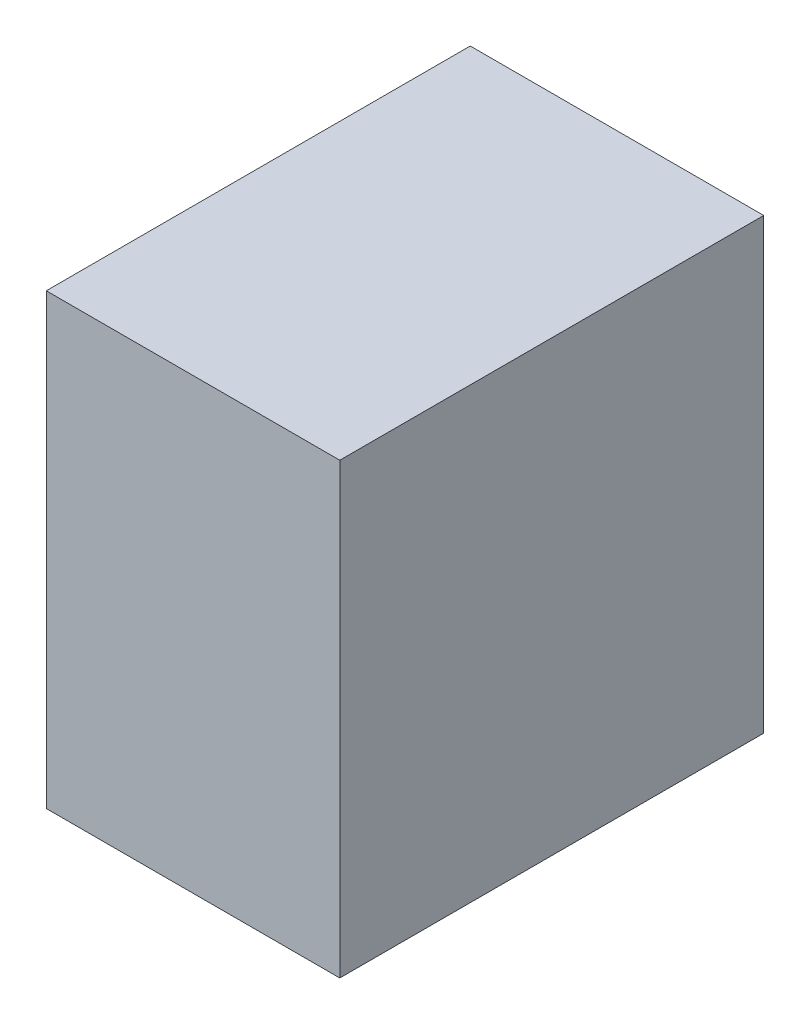
ISO-10303-21;
HEADER;
FILE_DESCRIPTION(('STEP AP214'),'2;1');
FILE_NAME('part.step','',(''),(''),'','','');
FILE_SCHEMA(('AUTOMOTIVE_DESIGN { 1 0 10303 214 1 1 1 1 }'));
ENDSEC;
DATA;
#1=APPLICATION_CONTEXT('core data for automotive mechanical design processes');
#2=APPLICATION_PROTOCOL_DEFINITION('international standard','automotive_design',2000,#1);
#3=PRODUCT_CONTEXT('',#1,'mechanical');
#4=PRODUCT('Part','Part','',(#3));
#5=PRODUCT_RELATED_PRODUCT_CATEGORY('part','',(#4));
#6=PRODUCT_DEFINITION_FORMATION('','',#4);
#7=PRODUCT_DEFINITION_CONTEXT('part definition',#1,'design');
#8=PRODUCT_DEFINITION('design','',#6,#7);
#9=PRODUCT_DEFINITION_SHAPE('','',#8);
#10=(LENGTH_UNIT() NAMED_UNIT(*) SI_UNIT(.MILLI.,.METRE.));
#11=(NAMED_UNIT(*) PLANE_ANGLE_UNIT() SI_UNIT($,.RADIAN.));
#12=(NAMED_UNIT(*) SI_UNIT($,.STERADIAN.) SOLID_ANGLE_UNIT());
#13=UNCERTAINTY_MEASURE_WITH_UNIT(LENGTH_MEASURE(1.E-05),#10,'distance_accuracy_value','');
#14=(GEOMETRIC_REPRESENTATION_CONTEXT(3) GLOBAL_UNCERTAINTY_ASSIGNED_CONTEXT((#13)) GLOBAL_UNIT_ASSIGNED_CONTEXT((#10,
#11,#12)) REPRESENTATION_CONTEXT('',''));
#15=CARTESIAN_POINT('',(0.,0.,0.));
#16=DIRECTION('',(0.,0.,1.));
#17=DIRECTION('',(1.,0.,0.));
#18=AXIS2_PLACEMENT_3D('',#15,#16,#17);
#19=CARTESIAN_POINT('',(-85.484794442748,55.,-24.1006217493925));
#20=DIRECTION('',(1.,0.,0.));
#21=DIRECTION('',(0.,0.,-1.));
#22=AXIS2_PLACEMENT_3D('',#19,#20,#21);
#23=PLANE('',#22);
#24=DIRECTION('',(0.,0.,1.));
#25=VECTOR('',#24,1.);
#26=CARTESIAN_POINT('',(-85.484794442748,0.,-24.1006217493925));
#27=LINE('',#26,#25);
#28=CARTESIAN_POINT('',(-85.484794442748,0.,-24.1006217493925));
#29=VERTEX_POINT('',#28);
#30=CARTESIAN_POINT('',(-85.484794442748,0.,27.8993782506075));
#31=VERTEX_POINT('',#30);
#32=EDGE_CURVE('E96',#29,#31,#27,.T.);
#33=ORIENTED_EDGE('',*,*,#32,.T.);
#34=DIRECTION('',(0.,-1.,0.));
#35=VECTOR('',#34,1.);
#36=CARTESIAN_POINT('',(-85.484794442748,55.,27.8993782506075));
#37=LINE('',#36,#35);
#38=CARTESIAN_POINT('',(-85.484794442748,55.,27.8993782506075));
#39=VERTEX_POINT('',#38);
#40=EDGE_CURVE('E11',#39,#31,#37,.T.);
#41=ORIENTED_EDGE('',*,*,#40,.F.);
#42=DIRECTION('',(0.,0.,1.));
#43=VECTOR('',#42,1.);
#44=CARTESIAN_POINT('',(-85.484794442748,55.,-24.1006217493925));
#45=LINE('',#44,#43);
#46=CARTESIAN_POINT('',(-85.484794442748,55.,-24.1006217493925));
#47=VERTEX_POINT('',#46);
#48=EDGE_CURVE('E84',#47,#39,#45,.T.);
#49=ORIENTED_EDGE('',*,*,#48,.F.);
#50=DIRECTION('',(0.,-1.,0.));
#51=VECTOR('',#50,1.);
#52=CARTESIAN_POINT('',(-85.484794442748,55.,-24.1006217493925));
#53=LINE('',#52,#51);
#54=EDGE_CURVE('E92',#47,#29,#53,.T.);
#55=ORIENTED_EDGE('',*,*,#54,.T.);
#56=EDGE_LOOP('',(#33,#41,#49,#55));
#57=FACE_BOUND('',#56,.T.);
#58=ADVANCED_FACE('F33',(#57),#23,.F.);
#59=CARTESIAN_POINT('',(-85.484794442748,55.,27.8993782506075));
#60=DIRECTION('',(0.,0.,-1.));
#61=DIRECTION('',(-1.,0.,0.));
#62=AXIS2_PLACEMENT_3D('',#59,#60,#61);
#63=PLANE('',#62);
#64=DIRECTION('',(1.,0.,0.));
#65=VECTOR('',#64,1.);
#66=CARTESIAN_POINT('',(-85.484794442748,0.,27.8993782506075));
#67=LINE('',#66,#65);
#68=CARTESIAN_POINT('',(-49.484794442748,0.,27.8993782506075));
#69=VERTEX_POINT('',#68);
#70=EDGE_CURVE('E88',#31,#69,#67,.T.);
#71=ORIENTED_EDGE('',*,*,#70,.T.);
#72=DIRECTION('',(0.,-1.,0.));
#73=VECTOR('',#72,1.);
#74=CARTESIAN_POINT('',(-49.484794442748,55.,27.8993782506075));
#75=LINE('',#74,#73);
#76=CARTESIAN_POINT('',(-49.484794442748,55.,27.8993782506075));
#77=VERTEX_POINT('',#76);
#78=EDGE_CURVE('E41',#77,#69,#75,.T.);
#79=ORIENTED_EDGE('',*,*,#78,.F.);
#80=DIRECTION('',(1.,0.,0.));
#81=VECTOR('',#80,1.);
#82=CARTESIAN_POINT('',(-85.484794442748,55.,27.8993782506075));
#83=LINE('',#82,#81);
#84=EDGE_CURVE('E79',#39,#77,#83,.T.);
#85=ORIENTED_EDGE('',*,*,#84,.F.);
#86=ORIENTED_EDGE('',*,*,#40,.T.);
#87=EDGE_LOOP('',(#71,#79,#85,#86));
#88=FACE_BOUND('',#87,.T.);
#89=ADVANCED_FACE('F87',(#88),#63,.F.);
#90=CARTESIAN_POINT('',(-49.484794442748,55.,-24.1006217493925));
#91=DIRECTION('',(-1.,0.,0.));
#92=DIRECTION('',(0.,0.,1.));
#93=AXIS2_PLACEMENT_3D('',#90,#91,#92);
#94=PLANE('',#93);
#95=DIRECTION('',(0.,0.,-1.));
#96=VECTOR('',#95,1.);
#97=CARTESIAN_POINT('',(-49.484794442748,0.,-24.1006217493925));
#98=LINE('',#97,#96);
#99=CARTESIAN_POINT('',(-49.484794442748,0.,-24.1006217493925));
#100=VERTEX_POINT('',#99);
#101=EDGE_CURVE('E66',#69,#100,#98,.T.);
#102=ORIENTED_EDGE('',*,*,#101,.T.);
#103=DIRECTION('',(0.,-1.,0.));
#104=VECTOR('',#103,1.);
#105=CARTESIAN_POINT('',(-49.484794442748,55.,-24.1006217493925));
#106=LINE('',#105,#104);
#107=CARTESIAN_POINT('',(-49.484794442748,55.,-24.1006217493925));
#108=VERTEX_POINT('',#107);
#109=EDGE_CURVE('E89',#108,#100,#106,.T.);
#110=ORIENTED_EDGE('',*,*,#109,.F.);
#111=DIRECTION('',(0.,0.,-1.));
#112=VECTOR('',#111,1.);
#113=CARTESIAN_POINT('',(-49.484794442748,55.,-24.1006217493925));
#114=LINE('',#113,#112);
#115=EDGE_CURVE('E82',#77,#108,#114,.T.);
#116=ORIENTED_EDGE('',*,*,#115,.F.);
#117=ORIENTED_EDGE('',*,*,#78,.T.);
#118=EDGE_LOOP('',(#102,#110,#116,#117));
#119=FACE_BOUND('',#118,.T.);
#120=ADVANCED_FACE('F90',(#119),#94,.F.);
#121=CARTESIAN_POINT('',(-85.484794442748,55.,-24.1006217493925));
#122=DIRECTION('',(0.,0.,1.));
#123=DIRECTION('',(1.,0.,0.));
#124=AXIS2_PLACEMENT_3D('',#121,#122,#123);
#125=PLANE('',#124);
#126=DIRECTION('',(-1.,0.,0.));
#127=VECTOR('',#126,1.);
#128=CARTESIAN_POINT('',(-85.484794442748,0.,-24.1006217493925));
#129=LINE('',#128,#127);
#130=EDGE_CURVE('E72',#100,#29,#129,.T.);
#131=ORIENTED_EDGE('',*,*,#130,.T.);
#132=ORIENTED_EDGE('',*,*,#54,.F.);
#133=DIRECTION('',(-1.,0.,0.));
#134=VECTOR('',#133,1.);
#135=CARTESIAN_POINT('',(-85.484794442748,55.,-24.1006217493925));
#136=LINE('',#135,#134);
#137=EDGE_CURVE('E49',#108,#47,#136,.T.);
#138=ORIENTED_EDGE('',*,*,#137,.F.);
#139=ORIENTED_EDGE('',*,*,#109,.T.);
#140=EDGE_LOOP('',(#131,#132,#138,#139));
#141=FACE_BOUND('',#140,.T.);
#142=ADVANCED_FACE('F103',(#141),#125,.F.);
#143=CARTESIAN_POINT('',(0.,55.,0.));
#144=DIRECTION('',(0.,1.,0.));
#145=DIRECTION('',(0.,0.,1.));
#146=AXIS2_PLACEMENT_3D('',#143,#144,#145);
#147=PLANE('',#146);
#148=ORIENTED_EDGE('',*,*,#48,.T.);
#149=ORIENTED_EDGE('',*,*,#84,.T.);
#150=ORIENTED_EDGE('',*,*,#115,.T.);
#151=ORIENTED_EDGE('',*,*,#137,.T.);
#152=EDGE_LOOP('',(#148,#149,#150,#151));
#153=FACE_BOUND('',#152,.T.);
#154=ADVANCED_FACE('F80',(#153),#147,.T.);
#155=CARTESIAN_POINT('',(0.,0.,0.));
#156=DIRECTION('',(0.,1.,0.));
#157=DIRECTION('',(0.,0.,1.));
#158=AXIS2_PLACEMENT_3D('',#155,#156,#157);
#159=PLANE('',#158);
#160=ORIENTED_EDGE('',*,*,#32,.F.);
#161=ORIENTED_EDGE('',*,*,#130,.F.);
#162=ORIENTED_EDGE('',*,*,#101,.F.);
#163=ORIENTED_EDGE('',*,*,#70,.F.);
#164=EDGE_LOOP('',(#160,#161,#162,#163));
#165=FACE_BOUND('',#164,.T.);
#166=ADVANCED_FACE('F106',(#165),#159,.F.);
#167=CLOSED_SHELL('',(#58,#89,#120,#142,#154,#166));
#168=MANIFOLD_SOLID_BREP('B2',#167);
#169=ADVANCED_BREP_SHAPE_REPRESENTATION('',(#18,#168),#14);
#170=SHAPE_DEFINITION_REPRESENTATION(#9,#169);
ENDSEC;
END-ISO-10303-21;
